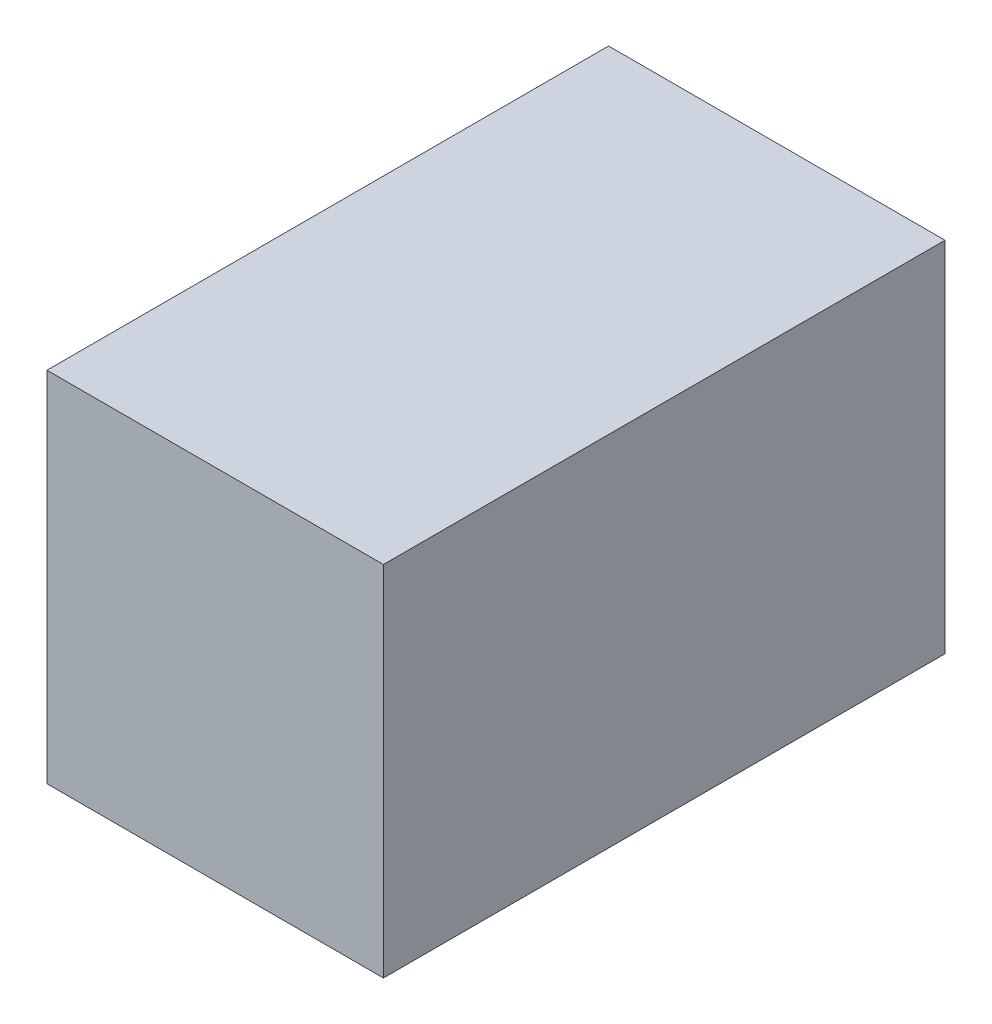
ISO-10303-21;
HEADER;
FILE_DESCRIPTION(('STEP AP214'),'2;1');
FILE_NAME('part.step','',(''),(''),'','','');
FILE_SCHEMA(('AUTOMOTIVE_DESIGN { 1 0 10303 214 1 1 1 1 }'));
ENDSEC;
DATA;
#1=APPLICATION_CONTEXT('core data for automotive mechanical design processes');
#2=APPLICATION_PROTOCOL_DEFINITION('international standard','automotive_design',2000,#1);
#3=PRODUCT_CONTEXT('',#1,'mechanical');
#4=PRODUCT('Part','Part','',(#3));
#5=PRODUCT_RELATED_PRODUCT_CATEGORY('part','',(#4));
#6=PRODUCT_DEFINITION_FORMATION('','',#4);
#7=PRODUCT_DEFINITION_CONTEXT('part definition',#1,'design');
#8=PRODUCT_DEFINITION('design','',#6,#7);
#9=PRODUCT_DEFINITION_SHAPE('','',#8);
#10=(LENGTH_UNIT() NAMED_UNIT(*) SI_UNIT(.MILLI.,.METRE.));
#11=(NAMED_UNIT(*) PLANE_ANGLE_UNIT() SI_UNIT($,.RADIAN.));
#12=(NAMED_UNIT(*) SI_UNIT($,.STERADIAN.) SOLID_ANGLE_UNIT());
#13=UNCERTAINTY_MEASURE_WITH_UNIT(LENGTH_MEASURE(1.E-05),#10,'distance_accuracy_value','');
#14=(GEOMETRIC_REPRESENTATION_CONTEXT(3) GLOBAL_UNCERTAINTY_ASSIGNED_CONTEXT((#13)) GLOBAL_UNIT_ASSIGNED_CONTEXT((#10,
#11,#12)) REPRESENTATION_CONTEXT('',''));
#15=CARTESIAN_POINT('',(0.,0.,0.));
#16=DIRECTION('',(0.,0.,1.));
#17=DIRECTION('',(1.,0.,0.));
#18=AXIS2_PLACEMENT_3D('',#15,#16,#17);
#19=CARTESIAN_POINT('',(19.,9.175,-17.525));
#20=DIRECTION('',(0.,0.,1.));
#21=DIRECTION('',(0.,-1.,0.));
#22=AXIS2_PLACEMENT_3D('',#19,#20,#21);
#23=PLANE('',#22);
#24=DIRECTION('',(0.,-1.,0.));
#25=VECTOR('',#24,1.);
#26=CARTESIAN_POINT('',(12.,9.175,-17.525));
#27=LINE('',#26,#25);
#28=CARTESIAN_POINT('',(12.,9.175,-17.525));
#29=VERTEX_POINT('',#28);
#30=CARTESIAN_POINT('',(12.,-9.175,-17.525));
#31=VERTEX_POINT('',#30);
#32=EDGE_CURVE('E202',#29,#31,#27,.T.);
#33=ORIENTED_EDGE('',*,*,#32,.F.);
#34=DIRECTION('',(1.,0.,0.));
#35=VECTOR('',#34,1.);
#36=CARTESIAN_POINT('',(0.,9.175,-17.525));
#37=LINE('',#36,#35);
#38=CARTESIAN_POINT('',(0.,9.175,-17.525));
#39=VERTEX_POINT('',#38);
#40=EDGE_CURVE('E206',#39,#29,#37,.T.);
#41=ORIENTED_EDGE('',*,*,#40,.F.);
#42=DIRECTION('',(0.,1.,0.));
#43=VECTOR('',#42,1.);
#44=CARTESIAN_POINT('',(0.,9.175,-17.525));
#45=LINE('',#44,#43);
#46=CARTESIAN_POINT('',(0.,11.175,-17.525));
#47=VERTEX_POINT('',#46);
#48=EDGE_CURVE('E92',#39,#47,#45,.T.);
#49=ORIENTED_EDGE('',*,*,#48,.T.);
#50=DIRECTION('',(-1.,0.,0.));
#51=VECTOR('',#50,1.);
#52=CARTESIAN_POINT('',(19.,11.175,-17.525));
#53=LINE('',#52,#51);
#54=CARTESIAN_POINT('',(21.,11.175,-17.525));
#55=VERTEX_POINT('',#54);
#56=EDGE_CURVE('E11',#55,#47,#53,.T.);
#57=ORIENTED_EDGE('',*,*,#56,.F.);
#58=DIRECTION('',(0.,1.,0.));
#59=VECTOR('',#58,1.);
#60=CARTESIAN_POINT('',(21.,9.175,-17.525));
#61=LINE('',#60,#59);
#62=CARTESIAN_POINT('',(21.,-11.175,-17.525));
#63=VERTEX_POINT('',#62);
#64=EDGE_CURVE('E120',#63,#55,#61,.T.);
#65=ORIENTED_EDGE('',*,*,#64,.F.);
#66=DIRECTION('',(-1.,0.,0.));
#67=VECTOR('',#66,1.);
#68=CARTESIAN_POINT('',(19.,-11.175,-17.525));
#69=LINE('',#68,#67);
#70=CARTESIAN_POINT('',(0.,-11.175,-17.525));
#71=VERTEX_POINT('',#70);
#72=EDGE_CURVE('E136',#63,#71,#69,.T.);
#73=ORIENTED_EDGE('',*,*,#72,.T.);
#74=CARTESIAN_POINT('',(0.,-9.175,-17.525));
#75=VERTEX_POINT('',#74);
#76=EDGE_CURVE('E140',#71,#75,#45,.T.);
#77=ORIENTED_EDGE('',*,*,#76,.T.);
#78=DIRECTION('',(-1.,0.,0.));
#79=VECTOR('',#78,1.);
#80=CARTESIAN_POINT('',(12.,-9.175,-17.525));
#81=LINE('',#80,#79);
#82=EDGE_CURVE('E198',#31,#75,#81,.T.);
#83=ORIENTED_EDGE('',*,*,#82,.F.);
#84=EDGE_LOOP('',(#33,#41,#49,#57,#65,#73,#77,#83));
#85=FACE_BOUND('',#84,.T.);
#86=ADVANCED_FACE('F43',(#85),#23,.F.);
#87=CARTESIAN_POINT('',(19.,11.175,15.525));
#88=DIRECTION('',(0.,-1.,0.));
#89=DIRECTION('',(0.,0.,-1.));
#90=AXIS2_PLACEMENT_3D('',#87,#88,#89);
#91=PLANE('',#90);
#92=DIRECTION('',(0.,0.,1.));
#93=VECTOR('',#92,1.);
#94=CARTESIAN_POINT('',(0.,11.175,15.525));
#95=LINE('',#94,#93);
#96=CARTESIAN_POINT('',(0.,11.175,17.525));
#97=VERTEX_POINT('',#96);
#98=EDGE_CURVE('E47',#47,#97,#95,.T.);
#99=ORIENTED_EDGE('',*,*,#98,.T.);
#100=DIRECTION('',(-1.,0.,0.));
#101=VECTOR('',#100,1.);
#102=CARTESIAN_POINT('',(19.,11.175,17.525));
#103=LINE('',#102,#101);
#104=CARTESIAN_POINT('',(21.,11.175,17.525));
#105=VERTEX_POINT('',#104);
#106=EDGE_CURVE('E53',#105,#97,#103,.T.);
#107=ORIENTED_EDGE('',*,*,#106,.F.);
#108=DIRECTION('',(0.,0.,1.));
#109=VECTOR('',#108,1.);
#110=CARTESIAN_POINT('',(21.,11.175,15.525));
#111=LINE('',#110,#109);
#112=EDGE_CURVE('E114',#55,#105,#111,.T.);
#113=ORIENTED_EDGE('',*,*,#112,.F.);
#114=ORIENTED_EDGE('',*,*,#56,.T.);
#115=EDGE_LOOP('',(#99,#107,#113,#114));
#116=FACE_BOUND('',#115,.T.);
#117=ADVANCED_FACE('F125',(#116),#91,.F.);
#118=CARTESIAN_POINT('',(19.,9.175,17.525));
#119=DIRECTION('',(0.,0.,-1.));
#120=DIRECTION('',(0.,1.,0.));
#121=AXIS2_PLACEMENT_3D('',#118,#119,#120);
#122=PLANE('',#121);
#123=DIRECTION('',(0.,-1.,0.));
#124=VECTOR('',#123,1.);
#125=CARTESIAN_POINT('',(0.,9.175,17.525));
#126=LINE('',#125,#124);
#127=CARTESIAN_POINT('',(0.,-11.175,17.525));
#128=VERTEX_POINT('',#127);
#129=EDGE_CURVE('E146',#97,#128,#126,.T.);
#130=ORIENTED_EDGE('',*,*,#129,.T.);
#131=DIRECTION('',(-1.,0.,0.));
#132=VECTOR('',#131,1.);
#133=CARTESIAN_POINT('',(19.,-11.175,17.525));
#134=LINE('',#133,#132);
#135=CARTESIAN_POINT('',(21.,-11.175,17.525));
#136=VERTEX_POINT('',#135);
#137=EDGE_CURVE('E129',#136,#128,#134,.T.);
#138=ORIENTED_EDGE('',*,*,#137,.F.);
#139=DIRECTION('',(0.,-1.,0.));
#140=VECTOR('',#139,1.);
#141=CARTESIAN_POINT('',(21.,9.175,17.525));
#142=LINE('',#141,#140);
#143=EDGE_CURVE('E117',#105,#136,#142,.T.);
#144=ORIENTED_EDGE('',*,*,#143,.F.);
#145=ORIENTED_EDGE('',*,*,#106,.T.);
#146=EDGE_LOOP('',(#130,#138,#144,#145));
#147=FACE_BOUND('',#146,.T.);
#148=ADVANCED_FACE('F131',(#147),#122,.F.);
#149=CARTESIAN_POINT('',(19.,-11.175,15.525));
#150=DIRECTION('',(0.,1.,0.));
#151=DIRECTION('',(0.,0.,1.));
#152=AXIS2_PLACEMENT_3D('',#149,#150,#151);
#153=PLANE('',#152);
#154=DIRECTION('',(0.,0.,-1.));
#155=VECTOR('',#154,1.);
#156=CARTESIAN_POINT('',(0.,-11.175,15.525));
#157=LINE('',#156,#155);
#158=EDGE_CURVE('E144',#128,#71,#157,.T.);
#159=ORIENTED_EDGE('',*,*,#158,.T.);
#160=ORIENTED_EDGE('',*,*,#72,.F.);
#161=DIRECTION('',(0.,0.,-1.));
#162=VECTOR('',#161,1.);
#163=CARTESIAN_POINT('',(21.,-11.175,15.525));
#164=LINE('',#163,#162);
#165=EDGE_CURVE('E70',#136,#63,#164,.T.);
#166=ORIENTED_EDGE('',*,*,#165,.F.);
#167=ORIENTED_EDGE('',*,*,#137,.T.);
#168=EDGE_LOOP('',(#159,#160,#166,#167));
#169=FACE_BOUND('',#168,.T.);
#170=ADVANCED_FACE('F224',(#169),#153,.F.);
#171=CARTESIAN_POINT('',(21.,0.,0.));
#172=DIRECTION('',(1.,0.,0.));
#173=DIRECTION('',(0.,0.,-1.));
#174=AXIS2_PLACEMENT_3D('',#171,#172,#173);
#175=PLANE('',#174);
#176=ORIENTED_EDGE('',*,*,#64,.T.);
#177=ORIENTED_EDGE('',*,*,#112,.T.);
#178=ORIENTED_EDGE('',*,*,#143,.T.);
#179=ORIENTED_EDGE('',*,*,#165,.T.);
#180=EDGE_LOOP('',(#176,#177,#178,#179));
#181=FACE_BOUND('',#180,.T.);
#182=ADVANCED_FACE('F45',(#181),#175,.T.);
#183=CARTESIAN_POINT('',(0.,0.,0.));
#184=DIRECTION('',(1.,0.,0.));
#185=DIRECTION('',(0.,0.,-1.));
#186=AXIS2_PLACEMENT_3D('',#183,#184,#185);
#187=PLANE('',#186);
#188=ORIENTED_EDGE('',*,*,#48,.F.);
#189=DIRECTION('',(0.,0.,1.));
#190=VECTOR('',#189,1.);
#191=CARTESIAN_POINT('',(0.,9.175,15.525));
#192=LINE('',#191,#190);
#193=CARTESIAN_POINT('',(0.,9.175,15.525));
#194=VERTEX_POINT('',#193);
#195=EDGE_CURVE('E182',#39,#194,#192,.T.);
#196=ORIENTED_EDGE('',*,*,#195,.T.);
#197=DIRECTION('',(0.,-1.,0.));
#198=VECTOR('',#197,1.);
#199=CARTESIAN_POINT('',(0.,9.175,15.525));
#200=LINE('',#199,#198);
#201=CARTESIAN_POINT('',(0.,-9.175,15.525));
#202=VERTEX_POINT('',#201);
#203=EDGE_CURVE('E61',#194,#202,#200,.T.);
#204=ORIENTED_EDGE('',*,*,#203,.T.);
#205=DIRECTION('',(0.,0.,-1.));
#206=VECTOR('',#205,1.);
#207=CARTESIAN_POINT('',(0.,-9.175,15.525));
#208=LINE('',#207,#206);
#209=EDGE_CURVE('E176',#202,#75,#208,.T.);
#210=ORIENTED_EDGE('',*,*,#209,.T.);
#211=ORIENTED_EDGE('',*,*,#76,.F.);
#212=ORIENTED_EDGE('',*,*,#158,.F.);
#213=ORIENTED_EDGE('',*,*,#129,.F.);
#214=ORIENTED_EDGE('',*,*,#98,.F.);
#215=EDGE_LOOP('',(#188,#196,#204,#210,#211,#212,#213,#214));
#216=FACE_BOUND('',#215,.T.);
#217=ADVANCED_FACE('F226',(#216),#187,.F.);
#218=CARTESIAN_POINT('',(19.,9.175,-15.525));
#219=DIRECTION('',(0.,0.,1.));
#220=DIRECTION('',(0.,-1.,0.));
#221=AXIS2_PLACEMENT_3D('',#218,#219,#220);
#222=PLANE('',#221);
#223=DIRECTION('',(0.,-1.,0.));
#224=VECTOR('',#223,1.);
#225=CARTESIAN_POINT('',(12.,9.175,-15.525));
#226=LINE('',#225,#224);
#227=CARTESIAN_POINT('',(12.,9.175,-15.525));
#228=VERTEX_POINT('',#227);
#229=CARTESIAN_POINT('',(12.,-9.175,-15.525));
#230=VERTEX_POINT('',#229);
#231=EDGE_CURVE('E190',#228,#230,#226,.T.);
#232=ORIENTED_EDGE('',*,*,#231,.T.);
#233=DIRECTION('',(-1.,0.,0.));
#234=VECTOR('',#233,1.);
#235=CARTESIAN_POINT('',(19.,-9.175,-15.525));
#236=LINE('',#235,#234);
#237=CARTESIAN_POINT('',(19.,-9.175,-15.525));
#238=VERTEX_POINT('',#237);
#239=EDGE_CURVE('E160',#238,#230,#236,.T.);
#240=ORIENTED_EDGE('',*,*,#239,.F.);
#241=DIRECTION('',(0.,1.,0.));
#242=VECTOR('',#241,1.);
#243=CARTESIAN_POINT('',(19.,9.175,-15.525));
#244=LINE('',#243,#242);
#245=CARTESIAN_POINT('',(19.,9.175,-15.525));
#246=VERTEX_POINT('',#245);
#247=EDGE_CURVE('E172',#238,#246,#244,.T.);
#248=ORIENTED_EDGE('',*,*,#247,.T.);
#249=DIRECTION('',(-1.,0.,0.));
#250=VECTOR('',#249,1.);
#251=CARTESIAN_POINT('',(19.,9.175,-15.525));
#252=LINE('',#251,#250);
#253=EDGE_CURVE('E151',#246,#228,#252,.T.);
#254=ORIENTED_EDGE('',*,*,#253,.T.);
#255=EDGE_LOOP('',(#232,#240,#248,#254));
#256=FACE_BOUND('',#255,.T.);
#257=ADVANCED_FACE('F250',(#256),#222,.T.);
#258=CARTESIAN_POINT('',(19.,9.175,15.525));
#259=DIRECTION('',(0.,-1.,0.));
#260=DIRECTION('',(0.,0.,-1.));
#261=AXIS2_PLACEMENT_3D('',#258,#259,#260);
#262=PLANE('',#261);
#263=ORIENTED_EDGE('',*,*,#195,.F.);
#264=ORIENTED_EDGE('',*,*,#40,.T.);
#265=DIRECTION('',(0.,0.,-1.));
#266=VECTOR('',#265,1.);
#267=CARTESIAN_POINT('',(12.,9.175,6.40038483128631));
#268=LINE('',#267,#266);
#269=EDGE_CURVE('E194',#228,#29,#268,.T.);
#270=ORIENTED_EDGE('',*,*,#269,.F.);
#271=ORIENTED_EDGE('',*,*,#253,.F.);
#272=DIRECTION('',(0.,0.,1.));
#273=VECTOR('',#272,1.);
#274=CARTESIAN_POINT('',(19.,9.175,15.525));
#275=LINE('',#274,#273);
#276=CARTESIAN_POINT('',(19.,9.175,15.525));
#277=VERTEX_POINT('',#276);
#278=EDGE_CURVE('E168',#246,#277,#275,.T.);
#279=ORIENTED_EDGE('',*,*,#278,.T.);
#280=DIRECTION('',(-1.,0.,0.));
#281=VECTOR('',#280,1.);
#282=CARTESIAN_POINT('',(19.,9.175,15.525));
#283=LINE('',#282,#281);
#284=EDGE_CURVE('E154',#277,#194,#283,.T.);
#285=ORIENTED_EDGE('',*,*,#284,.T.);
#286=EDGE_LOOP('',(#263,#264,#270,#271,#279,#285));
#287=FACE_BOUND('',#286,.T.);
#288=ADVANCED_FACE('F243',(#287),#262,.T.);
#289=CARTESIAN_POINT('',(19.,9.175,15.525));
#290=DIRECTION('',(0.,0.,-1.));
#291=DIRECTION('',(0.,1.,0.));
#292=AXIS2_PLACEMENT_3D('',#289,#290,#291);
#293=PLANE('',#292);
#294=ORIENTED_EDGE('',*,*,#203,.F.);
#295=ORIENTED_EDGE('',*,*,#284,.F.);
#296=DIRECTION('',(0.,-1.,0.));
#297=VECTOR('',#296,1.);
#298=CARTESIAN_POINT('',(19.,9.175,15.525));
#299=LINE('',#298,#297);
#300=CARTESIAN_POINT('',(19.,-9.175,15.525));
#301=VERTEX_POINT('',#300);
#302=EDGE_CURVE('E165',#277,#301,#299,.T.);
#303=ORIENTED_EDGE('',*,*,#302,.T.);
#304=DIRECTION('',(-1.,0.,0.));
#305=VECTOR('',#304,1.);
#306=CARTESIAN_POINT('',(19.,-9.175,15.525));
#307=LINE('',#306,#305);
#308=EDGE_CURVE('E157',#301,#202,#307,.T.);
#309=ORIENTED_EDGE('',*,*,#308,.T.);
#310=EDGE_LOOP('',(#294,#295,#303,#309));
#311=FACE_BOUND('',#310,.T.);
#312=ADVANCED_FACE('F247',(#311),#293,.T.);
#313=CARTESIAN_POINT('',(19.,-9.175,15.525));
#314=DIRECTION('',(0.,1.,0.));
#315=DIRECTION('',(0.,0.,1.));
#316=AXIS2_PLACEMENT_3D('',#313,#314,#315);
#317=PLANE('',#316);
#318=ORIENTED_EDGE('',*,*,#209,.F.);
#319=ORIENTED_EDGE('',*,*,#308,.F.);
#320=DIRECTION('',(0.,0.,-1.));
#321=VECTOR('',#320,1.);
#322=CARTESIAN_POINT('',(19.,-9.175,15.525));
#323=LINE('',#322,#321);
#324=EDGE_CURVE('E101',#301,#238,#323,.T.);
#325=ORIENTED_EDGE('',*,*,#324,.T.);
#326=ORIENTED_EDGE('',*,*,#239,.T.);
#327=DIRECTION('',(0.,0.,-1.));
#328=VECTOR('',#327,1.);
#329=CARTESIAN_POINT('',(12.,-9.175,6.40038483128631));
#330=LINE('',#329,#328);
#331=EDGE_CURVE('E186',#230,#31,#330,.T.);
#332=ORIENTED_EDGE('',*,*,#331,.T.);
#333=ORIENTED_EDGE('',*,*,#82,.T.);
#334=EDGE_LOOP('',(#318,#319,#325,#326,#332,#333));
#335=FACE_BOUND('',#334,.T.);
#336=ADVANCED_FACE('F252',(#335),#317,.T.);
#337=CARTESIAN_POINT('',(19.,0.,0.));
#338=DIRECTION('',(1.,0.,0.));
#339=DIRECTION('',(0.,0.,-1.));
#340=AXIS2_PLACEMENT_3D('',#337,#338,#339);
#341=PLANE('',#340);
#342=ORIENTED_EDGE('',*,*,#247,.F.);
#343=ORIENTED_EDGE('',*,*,#324,.F.);
#344=ORIENTED_EDGE('',*,*,#302,.F.);
#345=ORIENTED_EDGE('',*,*,#278,.F.);
#346=EDGE_LOOP('',(#342,#343,#344,#345));
#347=FACE_BOUND('',#346,.T.);
#348=ADVANCED_FACE('F248',(#347),#341,.F.);
#349=CARTESIAN_POINT('',(12.,9.175,6.40038483128631));
#350=DIRECTION('',(1.,0.,0.));
#351=DIRECTION('',(0.,1.,0.));
#352=AXIS2_PLACEMENT_3D('',#349,#350,#351);
#353=PLANE('',#352);
#354=ORIENTED_EDGE('',*,*,#269,.T.);
#355=ORIENTED_EDGE('',*,*,#32,.T.);
#356=ORIENTED_EDGE('',*,*,#331,.F.);
#357=ORIENTED_EDGE('',*,*,#231,.F.);
#358=EDGE_LOOP('',(#354,#355,#356,#357));
#359=FACE_BOUND('',#358,.T.);
#360=ADVANCED_FACE('F254',(#359),#353,.F.);
#361=CLOSED_SHELL('',(#86,#117,#148,#170,#182,#217,#257,#288,#312,#336,#348,#360));
#362=MANIFOLD_SOLID_BREP('B2',#361);
#363=ADVANCED_BREP_SHAPE_REPRESENTATION('',(#18,#362),#14);
#364=SHAPE_DEFINITION_REPRESENTATION(#9,#363);
ENDSEC;
END-ISO-10303-21;
